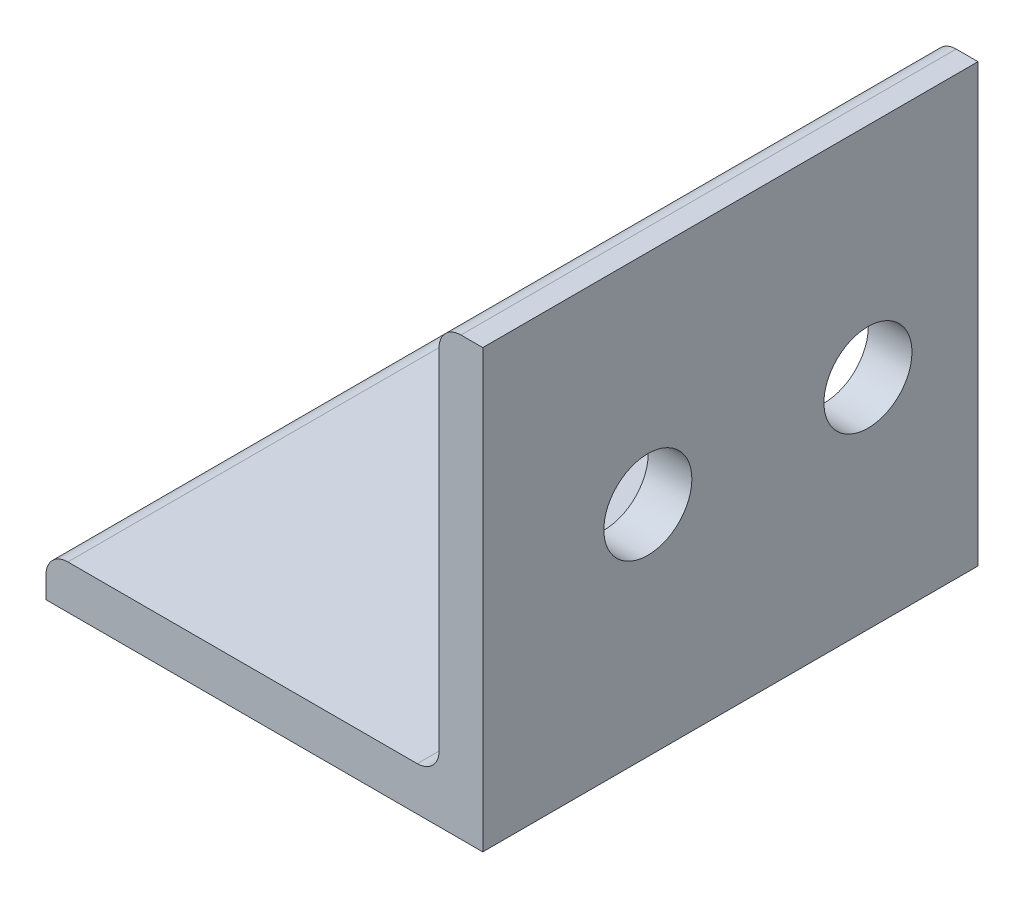
ISO-10303-21;
HEADER;
FILE_DESCRIPTION(('STEP AP214'),'2;1');
FILE_NAME('part.step','',(''),(''),'','','');
FILE_SCHEMA(('AUTOMOTIVE_DESIGN { 1 0 10303 214 1 1 1 1 }'));
ENDSEC;
DATA;
#1=APPLICATION_CONTEXT('core data for automotive mechanical design processes');
#2=APPLICATION_PROTOCOL_DEFINITION('international standard','automotive_design',2000,#1);
#3=PRODUCT_CONTEXT('',#1,'mechanical');
#4=PRODUCT('Part','Part','',(#3));
#5=PRODUCT_RELATED_PRODUCT_CATEGORY('part','',(#4));
#6=PRODUCT_DEFINITION_FORMATION('','',#4);
#7=PRODUCT_DEFINITION_CONTEXT('part definition',#1,'design');
#8=PRODUCT_DEFINITION('design','',#6,#7);
#9=PRODUCT_DEFINITION_SHAPE('','',#8);
#10=(LENGTH_UNIT() NAMED_UNIT(*) SI_UNIT(.MILLI.,.METRE.));
#11=(NAMED_UNIT(*) PLANE_ANGLE_UNIT() SI_UNIT($,.RADIAN.));
#12=(NAMED_UNIT(*) SI_UNIT($,.STERADIAN.) SOLID_ANGLE_UNIT());
#13=UNCERTAINTY_MEASURE_WITH_UNIT(LENGTH_MEASURE(1.E-05),#10,'distance_accuracy_value','');
#14=(GEOMETRIC_REPRESENTATION_CONTEXT(3) GLOBAL_UNCERTAINTY_ASSIGNED_CONTEXT((#13)) GLOBAL_UNIT_ASSIGNED_CONTEXT((#10,
#11,#12)) REPRESENTATION_CONTEXT('',''));
#15=CARTESIAN_POINT('',(0.,0.,0.));
#16=DIRECTION('',(0.,0.,1.));
#17=DIRECTION('',(1.,0.,0.));
#18=AXIS2_PLACEMENT_3D('',#15,#16,#17);
#19=CARTESIAN_POINT('',(-7.9375,0.793749999999998,152.4));
#20=DIRECTION('',(1.,0.,0.));
#21=DIRECTION('',(0.,0.,-1.));
#22=AXIS2_PLACEMENT_3D('',#19,#20,#21);
#23=PLANE('',#22);
#24=DIRECTION('',(0.,-1.,0.));
#25=VECTOR('',#24,1.);
#26=CARTESIAN_POINT('',(-7.9375,0.793749999999999,-134.4));
#27=LINE('',#26,#25);
#28=CARTESIAN_POINT('',(-7.9375,0.793749999999999,-134.4));
#29=VERTEX_POINT('',#28);
#30=CARTESIAN_POINT('',(-7.9375,0.,-134.4));
#31=VERTEX_POINT('',#30);
#32=EDGE_CURVE('E110',#29,#31,#27,.T.);
#33=ORIENTED_EDGE('',*,*,#32,.F.);
#34=DIRECTION('',(0.,0.,-1.));
#35=VECTOR('',#34,1.);
#36=CARTESIAN_POINT('',(-7.9375,0.793749999999999,152.4));
#37=LINE('',#36,#35);
#38=CARTESIAN_POINT('',(-7.9375,0.793749999999999,-152.4));
#39=VERTEX_POINT('',#38);
#40=EDGE_CURVE('E62',#29,#39,#37,.T.);
#41=ORIENTED_EDGE('',*,*,#40,.T.);
#42=DIRECTION('',(0.,-1.,0.));
#43=VECTOR('',#42,1.);
#44=CARTESIAN_POINT('',(-7.9375,0.793749999999998,-152.4));
#45=LINE('',#44,#43);
#46=CARTESIAN_POINT('',(-7.9375,0.,-152.4));
#47=VERTEX_POINT('',#46);
#48=EDGE_CURVE('E167',#39,#47,#45,.T.);
#49=ORIENTED_EDGE('',*,*,#48,.T.);
#50=DIRECTION('',(0.,0.,-1.));
#51=VECTOR('',#50,1.);
#52=CARTESIAN_POINT('',(-7.9375,0.,152.4));
#53=LINE('',#52,#51);
#54=EDGE_CURVE('E11',#31,#47,#53,.T.);
#55=ORIENTED_EDGE('',*,*,#54,.F.);
#56=EDGE_LOOP('',(#33,#41,#49,#55));
#57=FACE_BOUND('',#56,.T.);
#58=ADVANCED_FACE('F39',(#57),#23,.F.);
#59=CARTESIAN_POINT('',(-7.9375,0.,152.4));
#60=DIRECTION('',(0.,1.,0.));
#61=DIRECTION('',(0.,0.,1.));
#62=AXIS2_PLACEMENT_3D('',#59,#60,#61);
#63=PLANE('',#62);
#64=CARTESIAN_POINT('',(0.,0.,-143.4));
#65=DIRECTION('',(0.,-1.,0.));
#66=DIRECTION('',(0.,0.,-1.));
#67=AXIS2_PLACEMENT_3D('',#64,#65,#66);
#68=CIRCLE('',#67,1.5875);
#69=CARTESIAN_POINT('',(0.,0.,-144.9875));
#70=VERTEX_POINT('',#69);
#71=EDGE_CURVE('E236',#70,#70,#68,.T.);
#72=ORIENTED_EDGE('',*,*,#71,.F.);
#73=EDGE_LOOP('',(#72));
#74=FACE_BOUND('',#73,.T.);
#75=DIRECTION('',(1.,0.,0.));
#76=VECTOR('',#75,1.);
#77=CARTESIAN_POINT('',(-7.9375,0.,-134.4));
#78=LINE('',#77,#76);
#79=CARTESIAN_POINT('',(7.9375,0.,-134.4));
#80=VERTEX_POINT('',#79);
#81=EDGE_CURVE('E119',#31,#80,#78,.T.);
#82=ORIENTED_EDGE('',*,*,#81,.F.);
#83=ORIENTED_EDGE('',*,*,#54,.T.);
#84=DIRECTION('',(1.,0.,0.));
#85=VECTOR('',#84,1.);
#86=CARTESIAN_POINT('',(-7.9375,0.,-152.4));
#87=LINE('',#86,#85);
#88=CARTESIAN_POINT('',(7.9375,0.,-152.4));
#89=VERTEX_POINT('',#88);
#90=EDGE_CURVE('E163',#47,#89,#87,.T.);
#91=ORIENTED_EDGE('',*,*,#90,.T.);
#92=DIRECTION('',(0.,0.,-1.));
#93=VECTOR('',#92,1.);
#94=CARTESIAN_POINT('',(7.9375,0.,152.4));
#95=LINE('',#94,#93);
#96=EDGE_CURVE('E47',#80,#89,#95,.T.);
#97=ORIENTED_EDGE('',*,*,#96,.F.);
#98=EDGE_LOOP('',(#82,#83,#91,#97));
#99=FACE_BOUND('',#98,.T.);
#100=ADVANCED_FACE('F164',(#74,#99),#63,.F.);
#101=CARTESIAN_POINT('',(7.9375,0.,152.4));
#102=DIRECTION('',(-1.,0.,0.));
#103=DIRECTION('',(0.,0.,1.));
#104=AXIS2_PLACEMENT_3D('',#101,#102,#103);
#105=PLANE('',#104);
#106=CARTESIAN_POINT('',(7.9375,7.93749999999998,-140.4));
#107=DIRECTION('',(1.,0.,0.));
#108=DIRECTION('',(0.,0.,-1.));
#109=AXIS2_PLACEMENT_3D('',#106,#107,#108);
#110=CIRCLE('',#109,1.59999999999991);
#111=CARTESIAN_POINT('',(7.9375,7.93749999999998,-142.));
#112=VERTEX_POINT('',#111);
#113=EDGE_CURVE('E208',#112,#112,#110,.T.);
#114=ORIENTED_EDGE('',*,*,#113,.F.);
#115=EDGE_LOOP('',(#114));
#116=FACE_BOUND('',#115,.T.);
#117=CARTESIAN_POINT('',(7.9375,7.93749999999998,-148.4));
#118=DIRECTION('',(1.,0.,0.));
#119=DIRECTION('',(0.,0.,-1.));
#120=AXIS2_PLACEMENT_3D('',#117,#118,#119);
#121=CIRCLE('',#120,1.59999999999991);
#122=CARTESIAN_POINT('',(7.9375,7.93749999999998,-150.));
#123=VERTEX_POINT('',#122);
#124=EDGE_CURVE('E201',#123,#123,#121,.T.);
#125=ORIENTED_EDGE('',*,*,#124,.F.);
#126=EDGE_LOOP('',(#125));
#127=FACE_BOUND('',#126,.T.);
#128=DIRECTION('',(0.,1.,0.));
#129=VECTOR('',#128,1.);
#130=CARTESIAN_POINT('',(7.9375,0.,-134.4));
#131=LINE('',#130,#129);
#132=CARTESIAN_POINT('',(7.9375,15.875,-134.4));
#133=VERTEX_POINT('',#132);
#134=EDGE_CURVE('E160',#80,#133,#131,.T.);
#135=ORIENTED_EDGE('',*,*,#134,.F.);
#136=ORIENTED_EDGE('',*,*,#96,.T.);
#137=DIRECTION('',(0.,1.,0.));
#138=VECTOR('',#137,1.);
#139=CARTESIAN_POINT('',(7.9375,0.,-152.4));
#140=LINE('',#139,#138);
#141=CARTESIAN_POINT('',(7.9375,15.875,-152.4));
#142=VERTEX_POINT('',#141);
#143=EDGE_CURVE('E158',#89,#142,#140,.T.);
#144=ORIENTED_EDGE('',*,*,#143,.T.);
#145=DIRECTION('',(0.,0.,-1.));
#146=VECTOR('',#145,1.);
#147=CARTESIAN_POINT('',(7.9375,15.875,152.4));
#148=LINE('',#147,#146);
#149=EDGE_CURVE('E147',#133,#142,#148,.T.);
#150=ORIENTED_EDGE('',*,*,#149,.F.);
#151=EDGE_LOOP('',(#135,#136,#144,#150));
#152=FACE_BOUND('',#151,.T.);
#153=ADVANCED_FACE('F155',(#116,#127,#152),#105,.F.);
#154=CARTESIAN_POINT('',(7.14375,15.875,152.4));
#155=DIRECTION('',(0.,-1.,0.));
#156=DIRECTION('',(1.,0.,0.));
#157=AXIS2_PLACEMENT_3D('',#154,#155,#156);
#158=PLANE('',#157);
#159=DIRECTION('',(-1.,0.,0.));
#160=VECTOR('',#159,1.);
#161=CARTESIAN_POINT('',(7.9375,15.875,-134.4));
#162=LINE('',#161,#160);
#163=CARTESIAN_POINT('',(7.14375,15.875,-134.4));
#164=VERTEX_POINT('',#163);
#165=EDGE_CURVE('E226',#133,#164,#162,.T.);
#166=ORIENTED_EDGE('',*,*,#165,.F.);
#167=ORIENTED_EDGE('',*,*,#149,.T.);
#168=DIRECTION('',(-1.,0.,0.));
#169=VECTOR('',#168,1.);
#170=CARTESIAN_POINT('',(7.14375,15.875,-152.4));
#171=LINE('',#170,#169);
#172=CARTESIAN_POINT('',(7.14375,15.875,-152.4));
#173=VERTEX_POINT('',#172);
#174=EDGE_CURVE('E172',#142,#173,#171,.T.);
#175=ORIENTED_EDGE('',*,*,#174,.T.);
#176=DIRECTION('',(0.,0.,-1.));
#177=VECTOR('',#176,1.);
#178=CARTESIAN_POINT('',(7.14375,15.875,152.4));
#179=LINE('',#178,#177);
#180=EDGE_CURVE('E144',#164,#173,#179,.T.);
#181=ORIENTED_EDGE('',*,*,#180,.F.);
#182=EDGE_LOOP('',(#166,#167,#175,#181));
#183=FACE_BOUND('',#182,.T.);
#184=ADVANCED_FACE('F250',(#183),#158,.F.);
#185=CARTESIAN_POINT('',(7.14375,15.08125,152.4));
#186=DIRECTION('',(0.,0.,-1.));
#187=DIRECTION('',(-1.,0.,0.));
#188=AXIS2_PLACEMENT_3D('',#185,#186,#187);
#189=CYLINDRICAL_SURFACE('',#188,0.793749999999998);
#190=CARTESIAN_POINT('',(7.14375,15.08125,-134.4));
#191=DIRECTION('',(0.,0.,1.));
#192=DIRECTION('',(1.,0.,0.));
#193=AXIS2_PLACEMENT_3D('',#190,#191,#192);
#194=CIRCLE('',#193,0.793749999999999);
#195=CARTESIAN_POINT('',(6.35,15.08125,-134.4));
#196=VERTEX_POINT('',#195);
#197=EDGE_CURVE('E223',#164,#196,#194,.T.);
#198=ORIENTED_EDGE('',*,*,#197,.F.);
#199=ORIENTED_EDGE('',*,*,#180,.T.);
#200=CARTESIAN_POINT('',(7.14375,15.08125,-152.4));
#201=DIRECTION('',(0.,0.,1.));
#202=DIRECTION('',(-1.,0.,0.));
#203=AXIS2_PLACEMENT_3D('',#200,#201,#202);
#204=CIRCLE('',#203,0.793749999999998);
#205=CARTESIAN_POINT('',(6.35,15.08125,-152.4));
#206=VERTEX_POINT('',#205);
#207=EDGE_CURVE('E176',#173,#206,#204,.T.);
#208=ORIENTED_EDGE('',*,*,#207,.T.);
#209=DIRECTION('',(0.,0.,-1.));
#210=VECTOR('',#209,1.);
#211=CARTESIAN_POINT('',(6.35,15.08125,152.4));
#212=LINE('',#211,#210);
#213=EDGE_CURVE('E141',#196,#206,#212,.T.);
#214=ORIENTED_EDGE('',*,*,#213,.F.);
#215=EDGE_LOOP('',(#198,#199,#208,#214));
#216=FACE_BOUND('',#215,.T.);
#217=ADVANCED_FACE('F257',(#216),#189,.T.);
#218=CARTESIAN_POINT('',(6.35,15.08125,152.4));
#219=DIRECTION('',(1.,0.,0.));
#220=DIRECTION('',(0.,1.,0.));
#221=AXIS2_PLACEMENT_3D('',#218,#219,#220);
#222=PLANE('',#221);
#223=CARTESIAN_POINT('',(6.35,7.93749999999998,-140.4));
#224=DIRECTION('',(1.,0.,0.));
#225=DIRECTION('',(0.,1.,0.));
#226=AXIS2_PLACEMENT_3D('',#223,#224,#225);
#227=CIRCLE('',#226,1.59999999999991);
#228=CARTESIAN_POINT('',(6.35,9.53749999999988,-140.4));
#229=VERTEX_POINT('',#228);
#230=EDGE_CURVE('E204',#229,#229,#227,.F.);
#231=ORIENTED_EDGE('',*,*,#230,.F.);
#232=EDGE_LOOP('',(#231));
#233=FACE_BOUND('',#232,.T.);
#234=CARTESIAN_POINT('',(6.35,7.93749999999998,-148.4));
#235=DIRECTION('',(1.,0.,0.));
#236=DIRECTION('',(0.,1.,0.));
#237=AXIS2_PLACEMENT_3D('',#234,#235,#236);
#238=CIRCLE('',#237,1.59999999999991);
#239=CARTESIAN_POINT('',(6.35,9.53749999999988,-148.4));
#240=VERTEX_POINT('',#239);
#241=EDGE_CURVE('E198',#240,#240,#238,.F.);
#242=ORIENTED_EDGE('',*,*,#241,.F.);
#243=EDGE_LOOP('',(#242));
#244=FACE_BOUND('',#243,.T.);
#245=DIRECTION('',(0.,-1.,0.));
#246=VECTOR('',#245,1.);
#247=CARTESIAN_POINT('',(6.35,15.08125,-134.4));
#248=LINE('',#247,#246);
#249=CARTESIAN_POINT('',(6.35,2.38124999999999,-134.4));
#250=VERTEX_POINT('',#249);
#251=EDGE_CURVE('E220',#196,#250,#248,.T.);
#252=ORIENTED_EDGE('',*,*,#251,.F.);
#253=ORIENTED_EDGE('',*,*,#213,.T.);
#254=DIRECTION('',(0.,-1.,0.));
#255=VECTOR('',#254,1.);
#256=CARTESIAN_POINT('',(6.35,15.08125,-152.4));
#257=LINE('',#256,#255);
#258=CARTESIAN_POINT('',(6.35,2.38124999999999,-152.4));
#259=VERTEX_POINT('',#258);
#260=EDGE_CURVE('E183',#206,#259,#257,.T.);
#261=ORIENTED_EDGE('',*,*,#260,.T.);
#262=DIRECTION('',(0.,0.,-1.));
#263=VECTOR('',#262,1.);
#264=CARTESIAN_POINT('',(6.35,2.38124999999999,152.4));
#265=LINE('',#264,#263);
#266=EDGE_CURVE('E138',#250,#259,#265,.T.);
#267=ORIENTED_EDGE('',*,*,#266,.F.);
#268=EDGE_LOOP('',(#252,#253,#261,#267));
#269=FACE_BOUND('',#268,.T.);
#270=ADVANCED_FACE('F261',(#233,#244,#269),#222,.F.);
#271=CARTESIAN_POINT('',(5.55625000000001,2.38124999999999,152.4));
#272=DIRECTION('',(0.,0.,-1.));
#273=DIRECTION('',(-1.,0.,0.));
#274=AXIS2_PLACEMENT_3D('',#271,#272,#273);
#275=CYLINDRICAL_SURFACE('',#274,0.793749999999998);
#276=CARTESIAN_POINT('',(5.55625000000001,2.38124999999999,-134.4));
#277=DIRECTION('',(0.,0.,-1.));
#278=DIRECTION('',(1.,0.,0.));
#279=AXIS2_PLACEMENT_3D('',#276,#277,#278);
#280=CIRCLE('',#279,0.793749999999999);
#281=CARTESIAN_POINT('',(5.55625000000001,1.5875,-134.4));
#282=VERTEX_POINT('',#281);
#283=EDGE_CURVE('E217',#250,#282,#280,.T.);
#284=ORIENTED_EDGE('',*,*,#283,.F.);
#285=ORIENTED_EDGE('',*,*,#266,.T.);
#286=CARTESIAN_POINT('',(5.55625000000001,2.38124999999999,-152.4));
#287=DIRECTION('',(0.,0.,-1.));
#288=DIRECTION('',(-1.,0.,0.));
#289=AXIS2_PLACEMENT_3D('',#286,#287,#288);
#290=CIRCLE('',#289,0.793749999999998);
#291=CARTESIAN_POINT('',(5.55625000000001,1.5875,-152.4));
#292=VERTEX_POINT('',#291);
#293=EDGE_CURVE('E187',#259,#292,#290,.T.);
#294=ORIENTED_EDGE('',*,*,#293,.T.);
#295=DIRECTION('',(0.,0.,-1.));
#296=VECTOR('',#295,1.);
#297=CARTESIAN_POINT('',(5.55625000000001,1.5875,152.4));
#298=LINE('',#297,#296);
#299=EDGE_CURVE('E130',#282,#292,#298,.T.);
#300=ORIENTED_EDGE('',*,*,#299,.F.);
#301=EDGE_LOOP('',(#284,#285,#294,#300));
#302=FACE_BOUND('',#301,.T.);
#303=ADVANCED_FACE('F265',(#302),#275,.F.);
#304=CARTESIAN_POINT('',(5.55625000000001,1.5875,152.4));
#305=DIRECTION('',(0.,-1.,0.));
#306=DIRECTION('',(1.,0.,0.));
#307=AXIS2_PLACEMENT_3D('',#304,#305,#306);
#308=PLANE('',#307);
#309=CARTESIAN_POINT('',(0.,1.5875,-143.4));
#310=DIRECTION('',(0.,-1.,0.));
#311=DIRECTION('',(1.,0.,0.));
#312=AXIS2_PLACEMENT_3D('',#309,#310,#311);
#313=CIRCLE('',#312,1.5875);
#314=CARTESIAN_POINT('',(1.5875,1.5875,-143.4));
#315=VERTEX_POINT('',#314);
#316=EDGE_CURVE('E115',#315,#315,#313,.F.);
#317=ORIENTED_EDGE('',*,*,#316,.F.);
#318=EDGE_LOOP('',(#317));
#319=FACE_BOUND('',#318,.T.);
#320=DIRECTION('',(-1.,0.,0.));
#321=VECTOR('',#320,1.);
#322=CARTESIAN_POINT('',(5.55625000000001,1.5875,-134.4));
#323=LINE('',#322,#321);
#324=CARTESIAN_POINT('',(-7.14375,1.5875,-134.4));
#325=VERTEX_POINT('',#324);
#326=EDGE_CURVE('E54',#282,#325,#323,.T.);
#327=ORIENTED_EDGE('',*,*,#326,.F.);
#328=ORIENTED_EDGE('',*,*,#299,.T.);
#329=DIRECTION('',(-1.,0.,0.));
#330=VECTOR('',#329,1.);
#331=CARTESIAN_POINT('',(5.55625000000001,1.5875,-152.4));
#332=LINE('',#331,#330);
#333=CARTESIAN_POINT('',(-7.14375,1.5875,-152.4));
#334=VERTEX_POINT('',#333);
#335=EDGE_CURVE('E132',#292,#334,#332,.T.);
#336=ORIENTED_EDGE('',*,*,#335,.T.);
#337=DIRECTION('',(0.,0.,-1.));
#338=VECTOR('',#337,1.);
#339=CARTESIAN_POINT('',(-7.14375,1.5875,152.4));
#340=LINE('',#339,#338);
#341=EDGE_CURVE('E126',#325,#334,#340,.T.);
#342=ORIENTED_EDGE('',*,*,#341,.F.);
#343=EDGE_LOOP('',(#327,#328,#336,#342));
#344=FACE_BOUND('',#343,.T.);
#345=ADVANCED_FACE('F194',(#319,#344),#308,.F.);
#346=CARTESIAN_POINT('',(-7.14375,0.793749999999999,152.4));
#347=DIRECTION('',(0.,0.,-1.));
#348=DIRECTION('',(-1.,0.,0.));
#349=AXIS2_PLACEMENT_3D('',#346,#347,#348);
#350=CYLINDRICAL_SURFACE('',#349,0.793749999999999);
#351=CARTESIAN_POINT('',(-7.14375,0.793749999999999,-134.4));
#352=DIRECTION('',(0.,0.,1.));
#353=DIRECTION('',(1.,0.,0.));
#354=AXIS2_PLACEMENT_3D('',#351,#352,#353);
#355=CIRCLE('',#354,0.793749999999999);
#356=EDGE_CURVE('E108',#325,#29,#355,.T.);
#357=ORIENTED_EDGE('',*,*,#356,.F.);
#358=ORIENTED_EDGE('',*,*,#341,.T.);
#359=CARTESIAN_POINT('',(-7.14375,0.793749999999999,-152.4));
#360=DIRECTION('',(0.,0.,1.));
#361=DIRECTION('',(-1.,0.,0.));
#362=AXIS2_PLACEMENT_3D('',#359,#360,#361);
#363=CIRCLE('',#362,0.793749999999999);
#364=EDGE_CURVE('E123',#334,#39,#363,.T.);
#365=ORIENTED_EDGE('',*,*,#364,.T.);
#366=ORIENTED_EDGE('',*,*,#40,.F.);
#367=EDGE_LOOP('',(#357,#358,#365,#366));
#368=FACE_BOUND('',#367,.T.);
#369=ADVANCED_FACE('F121',(#368),#350,.T.);
#370=CARTESIAN_POINT('',(7.14375,15.08125,-152.4));
#371=DIRECTION('',(0.,0.,-1.));
#372=DIRECTION('',(-1.,0.,0.));
#373=AXIS2_PLACEMENT_3D('',#370,#371,#372);
#374=PLANE('',#373);
#375=ORIENTED_EDGE('',*,*,#48,.F.);
#376=ORIENTED_EDGE('',*,*,#364,.F.);
#377=ORIENTED_EDGE('',*,*,#335,.F.);
#378=ORIENTED_EDGE('',*,*,#293,.F.);
#379=ORIENTED_EDGE('',*,*,#260,.F.);
#380=ORIENTED_EDGE('',*,*,#207,.F.);
#381=ORIENTED_EDGE('',*,*,#174,.F.);
#382=ORIENTED_EDGE('',*,*,#143,.F.);
#383=ORIENTED_EDGE('',*,*,#90,.F.);
#384=EDGE_LOOP('',(#375,#376,#377,#378,#379,#380,#381,#382,#383));
#385=FACE_BOUND('',#384,.T.);
#386=ADVANCED_FACE('F169',(#385),#374,.T.);
#387=CARTESIAN_POINT('',(-7.9385,7.93749999999998,-140.4));
#388=DIRECTION('',(1.,0.,0.));
#389=DIRECTION('',(0.,0.,-1.));
#390=AXIS2_PLACEMENT_3D('',#387,#388,#389);
#391=CYLINDRICAL_SURFACE('',#390,1.59999999999991);
#392=ORIENTED_EDGE('',*,*,#113,.T.);
#393=EDGE_LOOP('',(#392));
#394=FACE_BOUND('',#393,.T.);
#395=ORIENTED_EDGE('',*,*,#230,.T.);
#396=EDGE_LOOP('',(#395));
#397=FACE_BOUND('',#396,.T.);
#398=ADVANCED_FACE('F276',(#394,#397),#391,.F.);
#399=CARTESIAN_POINT('',(-7.9385,7.93749999999998,-148.4));
#400=DIRECTION('',(1.,0.,0.));
#401=DIRECTION('',(0.,0.,-1.));
#402=AXIS2_PLACEMENT_3D('',#399,#400,#401);
#403=CYLINDRICAL_SURFACE('',#402,1.59999999999991);
#404=ORIENTED_EDGE('',*,*,#124,.T.);
#405=EDGE_LOOP('',(#404));
#406=FACE_BOUND('',#405,.T.);
#407=ORIENTED_EDGE('',*,*,#241,.T.);
#408=EDGE_LOOP('',(#407));
#409=FACE_BOUND('',#408,.T.);
#410=ADVANCED_FACE('F279',(#406,#409),#403,.F.);
#411=CARTESIAN_POINT('',(-7.14375,0.793749999999999,-134.4));
#412=DIRECTION('',(0.,0.,1.));
#413=DIRECTION('',(1.,0.,0.));
#414=AXIS2_PLACEMENT_3D('',#411,#412,#413);
#415=PLANE('',#414);
#416=ORIENTED_EDGE('',*,*,#356,.T.);
#417=ORIENTED_EDGE('',*,*,#32,.T.);
#418=ORIENTED_EDGE('',*,*,#81,.T.);
#419=ORIENTED_EDGE('',*,*,#134,.T.);
#420=ORIENTED_EDGE('',*,*,#165,.T.);
#421=ORIENTED_EDGE('',*,*,#197,.T.);
#422=ORIENTED_EDGE('',*,*,#251,.T.);
#423=ORIENTED_EDGE('',*,*,#283,.T.);
#424=ORIENTED_EDGE('',*,*,#326,.T.);
#425=EDGE_LOOP('',(#416,#417,#418,#419,#420,#421,#422,#423,#424));
#426=FACE_BOUND('',#425,.T.);
#427=ADVANCED_FACE('F109',(#426),#415,.T.);
#428=CARTESIAN_POINT('',(0.,15.876,-143.4));
#429=DIRECTION('',(0.,-1.,0.));
#430=DIRECTION('',(0.,0.,-1.));
#431=AXIS2_PLACEMENT_3D('',#428,#429,#430);
#432=CYLINDRICAL_SURFACE('',#431,1.5875);
#433=ORIENTED_EDGE('',*,*,#71,.T.);
#434=EDGE_LOOP('',(#433));
#435=FACE_BOUND('',#434,.T.);
#436=ORIENTED_EDGE('',*,*,#316,.T.);
#437=EDGE_LOOP('',(#436));
#438=FACE_BOUND('',#437,.T.);
#439=ADVANCED_FACE('F241',(#435,#438),#432,.F.);
#440=CLOSED_SHELL('',(#58,#100,#153,#184,#217,#270,#303,#345,#369,#386,#398,#410,#427,#439));
#441=MANIFOLD_SOLID_BREP('B2',#440);
#442=ADVANCED_BREP_SHAPE_REPRESENTATION('',(#18,#441),#14);
#443=SHAPE_DEFINITION_REPRESENTATION(#9,#442);
ENDSEC;
END-ISO-10303-21;
